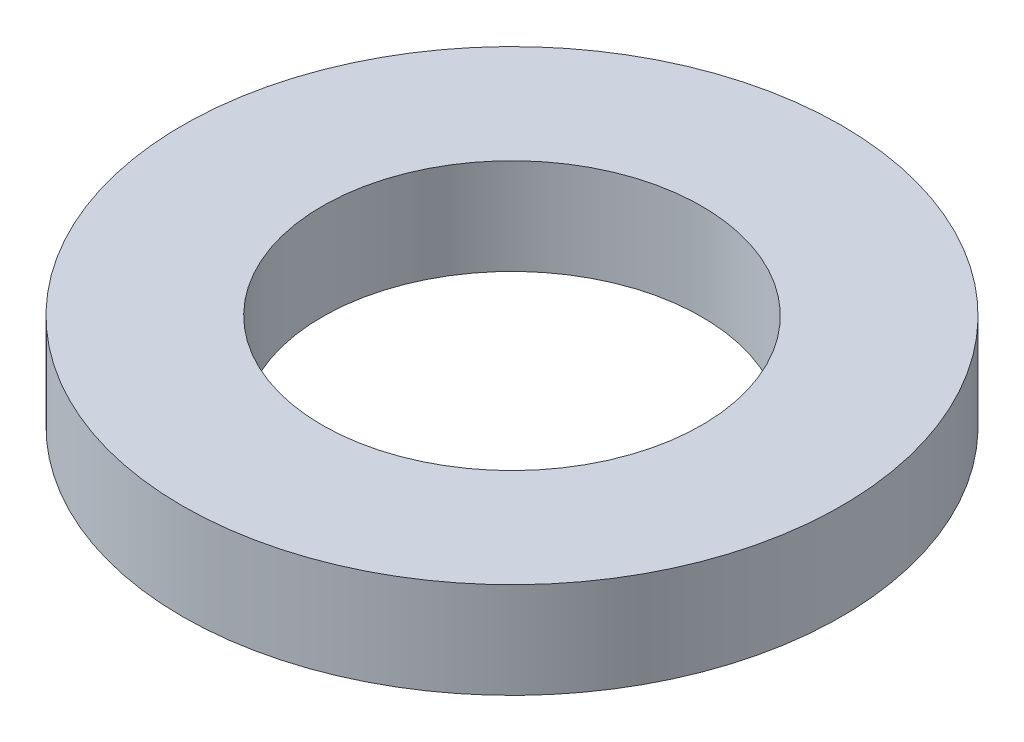
ISO-10303-21;
HEADER;
FILE_DESCRIPTION(('STEP AP214'),'2;1');
FILE_NAME('part.step','',(''),(''),'','','');
FILE_SCHEMA(('AUTOMOTIVE_DESIGN { 1 0 10303 214 1 1 1 1 }'));
ENDSEC;
DATA;
#1=APPLICATION_CONTEXT('core data for automotive mechanical design processes');
#2=APPLICATION_PROTOCOL_DEFINITION('international standard','automotive_design',2000,#1);
#3=PRODUCT_CONTEXT('',#1,'mechanical');
#4=PRODUCT('Part','Part','',(#3));
#5=PRODUCT_RELATED_PRODUCT_CATEGORY('part','',(#4));
#6=PRODUCT_DEFINITION_FORMATION('','',#4);
#7=PRODUCT_DEFINITION_CONTEXT('part definition',#1,'design');
#8=PRODUCT_DEFINITION('design','',#6,#7);
#9=PRODUCT_DEFINITION_SHAPE('','',#8);
#10=(LENGTH_UNIT() NAMED_UNIT(*) SI_UNIT(.MILLI.,.METRE.));
#11=(NAMED_UNIT(*) PLANE_ANGLE_UNIT() SI_UNIT($,.RADIAN.));
#12=(NAMED_UNIT(*) SI_UNIT($,.STERADIAN.) SOLID_ANGLE_UNIT());
#13=UNCERTAINTY_MEASURE_WITH_UNIT(LENGTH_MEASURE(1.E-05),#10,'distance_accuracy_value','');
#14=(GEOMETRIC_REPRESENTATION_CONTEXT(3) GLOBAL_UNCERTAINTY_ASSIGNED_CONTEXT((#13)) GLOBAL_UNIT_ASSIGNED_CONTEXT((#10,
#11,#12)) REPRESENTATION_CONTEXT('',''));
#15=CARTESIAN_POINT('',(0.,0.,0.));
#16=DIRECTION('',(0.,0.,1.));
#17=DIRECTION('',(1.,0.,0.));
#18=AXIS2_PLACEMENT_3D('',#15,#16,#17);
#19=CARTESIAN_POINT('',(0.,24.,0.));
#20=DIRECTION('',(0.,-1.,0.));
#21=DIRECTION('',(0.,0.,-1.));
#22=AXIS2_PLACEMENT_3D('',#19,#20,#21);
#23=CYLINDRICAL_SURFACE('',#22,82.5);
#24=CARTESIAN_POINT('',(0.,24.,0.));
#25=DIRECTION('',(0.,1.,0.));
#26=DIRECTION('',(0.,0.,1.));
#27=AXIS2_PLACEMENT_3D('',#24,#25,#26);
#28=CIRCLE('',#27,82.5);
#29=CARTESIAN_POINT('',(0.,24.,82.5));
#30=VERTEX_POINT('',#29);
#31=EDGE_CURVE('E10',#30,#30,#28,.T.);
#32=ORIENTED_EDGE('',*,*,#31,.F.);
#33=EDGE_LOOP('',(#32));
#34=FACE_BOUND('',#33,.T.);
#35=CARTESIAN_POINT('',(0.,0.,0.));
#36=DIRECTION('',(0.,1.,0.));
#37=DIRECTION('',(0.,0.,1.));
#38=AXIS2_PLACEMENT_3D('',#35,#36,#37);
#39=CIRCLE('',#38,82.5);
#40=CARTESIAN_POINT('',(0.,0.,82.5));
#41=VERTEX_POINT('',#40);
#42=EDGE_CURVE('E37',#41,#41,#39,.T.);
#43=ORIENTED_EDGE('',*,*,#42,.T.);
#44=EDGE_LOOP('',(#43));
#45=FACE_BOUND('',#44,.T.);
#46=ADVANCED_FACE('F40',(#34,#45),#23,.T.);
#47=CARTESIAN_POINT('',(0.,24.,0.));
#48=DIRECTION('',(0.,1.,0.));
#49=DIRECTION('',(0.,0.,1.));
#50=AXIS2_PLACEMENT_3D('',#47,#48,#49);
#51=PLANE('',#50);
#52=CARTESIAN_POINT('',(0.,24.,0.));
#53=DIRECTION('',(0.,1.,0.));
#54=DIRECTION('',(0.,0.,1.));
#55=AXIS2_PLACEMENT_3D('',#52,#53,#54);
#56=CIRCLE('',#55,47.5);
#57=CARTESIAN_POINT('',(0.,24.,47.5));
#58=VERTEX_POINT('',#57);
#59=EDGE_CURVE('E50',#58,#58,#56,.T.);
#60=ORIENTED_EDGE('',*,*,#59,.F.);
#61=EDGE_LOOP('',(#60));
#62=FACE_BOUND('',#61,.T.);
#63=ORIENTED_EDGE('',*,*,#31,.T.);
#64=EDGE_LOOP('',(#63));
#65=FACE_BOUND('',#64,.T.);
#66=ADVANCED_FACE('F59',(#62,#65),#51,.T.);
#67=CARTESIAN_POINT('',(0.,0.,0.));
#68=DIRECTION('',(0.,1.,0.));
#69=DIRECTION('',(0.,0.,1.));
#70=AXIS2_PLACEMENT_3D('',#67,#68,#69);
#71=PLANE('',#70);
#72=CARTESIAN_POINT('',(0.,0.,0.));
#73=DIRECTION('',(0.,1.,0.));
#74=DIRECTION('',(0.,0.,1.));
#75=AXIS2_PLACEMENT_3D('',#72,#73,#74);
#76=CIRCLE('',#75,47.5);
#77=CARTESIAN_POINT('',(0.,0.,47.5));
#78=VERTEX_POINT('',#77);
#79=EDGE_CURVE('E47',#78,#78,#76,.T.);
#80=ORIENTED_EDGE('',*,*,#79,.T.);
#81=EDGE_LOOP('',(#80));
#82=FACE_BOUND('',#81,.T.);
#83=ORIENTED_EDGE('',*,*,#42,.F.);
#84=EDGE_LOOP('',(#83));
#85=FACE_BOUND('',#84,.T.);
#86=ADVANCED_FACE('F58',(#82,#85),#71,.F.);
#87=CARTESIAN_POINT('',(0.,24.,0.));
#88=DIRECTION('',(0.,-1.,0.));
#89=DIRECTION('',(0.,0.,-1.));
#90=AXIS2_PLACEMENT_3D('',#87,#88,#89);
#91=CYLINDRICAL_SURFACE('',#90,47.5);
#92=ORIENTED_EDGE('',*,*,#59,.T.);
#93=EDGE_LOOP('',(#92));
#94=FACE_BOUND('',#93,.T.);
#95=ORIENTED_EDGE('',*,*,#79,.F.);
#96=EDGE_LOOP('',(#95));
#97=FACE_BOUND('',#96,.T.);
#98=ADVANCED_FACE('F54',(#94,#97),#91,.F.);
#99=CLOSED_SHELL('',(#46,#66,#86,#98));
#100=MANIFOLD_SOLID_BREP('B2',#99);
#101=ADVANCED_BREP_SHAPE_REPRESENTATION('',(#18,#100),#14);
#102=SHAPE_DEFINITION_REPRESENTATION(#9,#101);
ENDSEC;
END-ISO-10303-21;
